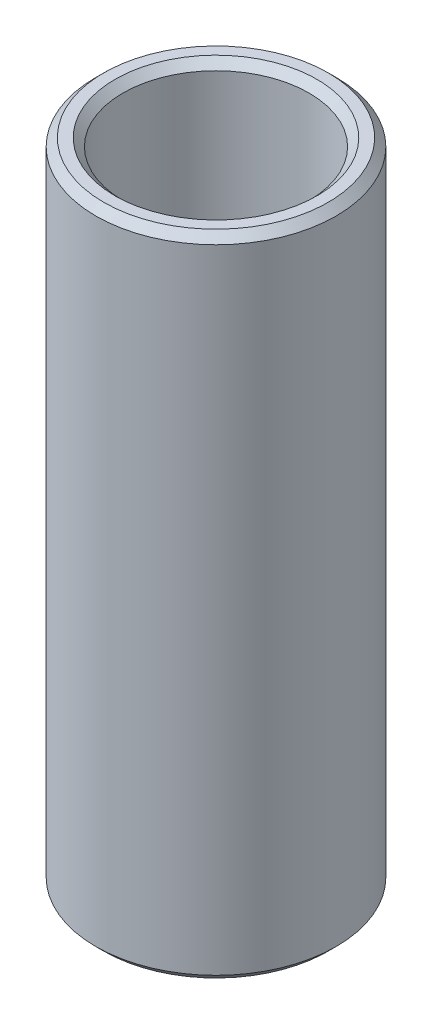
ISO-10303-21;
HEADER;
FILE_DESCRIPTION(('STEP AP214'),'2;1');
FILE_NAME('part.step','',(''),(''),'','','');
FILE_SCHEMA(('AUTOMOTIVE_DESIGN { 1 0 10303 214 1 1 1 1 }'));
ENDSEC;
DATA;
#1=APPLICATION_CONTEXT('core data for automotive mechanical design processes');
#2=APPLICATION_PROTOCOL_DEFINITION('international standard','automotive_design',2000,#1);
#3=PRODUCT_CONTEXT('',#1,'mechanical');
#4=PRODUCT('Part','Part','',(#3));
#5=PRODUCT_RELATED_PRODUCT_CATEGORY('part','',(#4));
#6=PRODUCT_DEFINITION_FORMATION('','',#4);
#7=PRODUCT_DEFINITION_CONTEXT('part definition',#1,'design');
#8=PRODUCT_DEFINITION('design','',#6,#7);
#9=PRODUCT_DEFINITION_SHAPE('','',#8);
#10=(LENGTH_UNIT() NAMED_UNIT(*) SI_UNIT(.MILLI.,.METRE.));
#11=(NAMED_UNIT(*) PLANE_ANGLE_UNIT() SI_UNIT($,.RADIAN.));
#12=(NAMED_UNIT(*) SI_UNIT($,.STERADIAN.) SOLID_ANGLE_UNIT());
#13=UNCERTAINTY_MEASURE_WITH_UNIT(LENGTH_MEASURE(1.E-05),#10,'distance_accuracy_value','');
#14=(GEOMETRIC_REPRESENTATION_CONTEXT(3) GLOBAL_UNCERTAINTY_ASSIGNED_CONTEXT((#13)) GLOBAL_UNIT_ASSIGNED_CONTEXT((#10,
#11,#12)) REPRESENTATION_CONTEXT('',''));
#15=CARTESIAN_POINT('',(0.,0.,0.));
#16=DIRECTION('',(0.,0.,1.));
#17=DIRECTION('',(1.,0.,0.));
#18=AXIS2_PLACEMENT_3D('',#15,#16,#17);
#19=CARTESIAN_POINT('',(0.,269.960897826019,0.));
#20=DIRECTION('',(0.,-1.,0.));
#21=DIRECTION('',(0.,0.,-1.));
#22=AXIS2_PLACEMENT_3D('',#19,#20,#21);
#23=CYLINDRICAL_SURFACE('',#22,50.);
#24=CARTESIAN_POINT('',(0.,3.29269688421191,0.));
#25=DIRECTION('',(0.,1.,0.));
#26=DIRECTION('',(0.,0.,1.));
#27=AXIS2_PLACEMENT_3D('',#24,#25,#26);
#28=CIRCLE('',#27,50.);
#29=CARTESIAN_POINT('',(0.,3.29269688421191,50.));
#30=VERTEX_POINT('',#29);
#31=EDGE_CURVE('E10',#30,#30,#28,.T.);
#32=ORIENTED_EDGE('',*,*,#31,.T.);
#33=EDGE_LOOP('',(#32));
#34=FACE_BOUND('',#33,.T.);
#35=CARTESIAN_POINT('',(0.,266.668200941807,0.));
#36=DIRECTION('',(0.,1.,0.));
#37=DIRECTION('',(0.,0.,1.));
#38=AXIS2_PLACEMENT_3D('',#35,#36,#37);
#39=CIRCLE('',#38,50.);
#40=CARTESIAN_POINT('',(0.,266.668200941807,50.));
#41=VERTEX_POINT('',#40);
#42=EDGE_CURVE('E50',#41,#41,#39,.F.);
#43=ORIENTED_EDGE('',*,*,#42,.T.);
#44=EDGE_LOOP('',(#43));
#45=FACE_BOUND('',#44,.T.);
#46=ADVANCED_FACE('F39',(#34,#45),#23,.T.);
#47=CARTESIAN_POINT('',(0.,269.960897826019,0.));
#48=DIRECTION('',(0.,1.,0.));
#49=DIRECTION('',(0.,0.,1.));
#50=AXIS2_PLACEMENT_3D('',#47,#48,#49);
#51=PLANE('',#50);
#52=CARTESIAN_POINT('',(0.,269.960897826019,0.));
#53=DIRECTION('',(0.,1.,0.));
#54=DIRECTION('',(0.,0.,1.));
#55=AXIS2_PLACEMENT_3D('',#52,#53,#54);
#56=CIRCLE('',#55,42.0311474916744);
#57=CARTESIAN_POINT('',(0.,269.960897826019,42.0311474916744));
#58=VERTEX_POINT('',#57);
#59=EDGE_CURVE('E58',#58,#58,#56,.F.);
#60=ORIENTED_EDGE('',*,*,#59,.T.);
#61=EDGE_LOOP('',(#60));
#62=FACE_BOUND('',#61,.T.);
#63=CARTESIAN_POINT('',(0.,269.960897826019,0.));
#64=DIRECTION('',(0.,1.,0.));
#65=DIRECTION('',(0.,0.,1.));
#66=AXIS2_PLACEMENT_3D('',#63,#64,#65);
#67=CIRCLE('',#66,46.707303115788);
#68=CARTESIAN_POINT('',(0.,269.960897826019,46.707303115788));
#69=VERTEX_POINT('',#68);
#70=EDGE_CURVE('E61',#69,#69,#67,.T.);
#71=ORIENTED_EDGE('',*,*,#70,.T.);
#72=EDGE_LOOP('',(#71));
#73=FACE_BOUND('',#72,.T.);
#74=ADVANCED_FACE('F88',(#62,#73),#51,.T.);
#75=CARTESIAN_POINT('',(0.,0.,0.));
#76=DIRECTION('',(0.,1.,0.));
#77=DIRECTION('',(0.,0.,1.));
#78=AXIS2_PLACEMENT_3D('',#75,#76,#77);
#79=PLANE('',#78);
#80=CARTESIAN_POINT('',(0.,0.,0.));
#81=DIRECTION('',(0.,1.,0.));
#82=DIRECTION('',(0.,0.,1.));
#83=AXIS2_PLACEMENT_3D('',#80,#81,#82);
#84=CIRCLE('',#83,42.0311474916744);
#85=CARTESIAN_POINT('',(0.,0.,42.0311474916744));
#86=VERTEX_POINT('',#85);
#87=EDGE_CURVE('E51',#86,#86,#84,.T.);
#88=ORIENTED_EDGE('',*,*,#87,.T.);
#89=EDGE_LOOP('',(#88));
#90=FACE_BOUND('',#89,.T.);
#91=CARTESIAN_POINT('',(0.,0.,0.));
#92=DIRECTION('',(0.,1.,0.));
#93=DIRECTION('',(0.,0.,1.));
#94=AXIS2_PLACEMENT_3D('',#91,#92,#93);
#95=CIRCLE('',#94,46.7073031157881);
#96=CARTESIAN_POINT('',(0.,0.,46.7073031157881));
#97=VERTEX_POINT('',#96);
#98=EDGE_CURVE('E54',#97,#97,#95,.F.);
#99=ORIENTED_EDGE('',*,*,#98,.T.);
#100=EDGE_LOOP('',(#99));
#101=FACE_BOUND('',#100,.T.);
#102=ADVANCED_FACE('F83',(#90,#101),#79,.F.);
#103=CARTESIAN_POINT('',(0.,269.960897826019,0.));
#104=DIRECTION('',(0.,-1.,0.));
#105=DIRECTION('',(0.,0.,-1.));
#106=AXIS2_PLACEMENT_3D('',#103,#104,#105);
#107=CYLINDRICAL_SURFACE('',#106,38.7384506074625);
#108=CARTESIAN_POINT('',(0.,266.668200941807,0.));
#109=DIRECTION('',(0.,1.,0.));
#110=DIRECTION('',(0.,0.,1.));
#111=AXIS2_PLACEMENT_3D('',#108,#109,#110);
#112=CIRCLE('',#111,38.7384506074625);
#113=CARTESIAN_POINT('',(0.,266.668200941807,38.7384506074625));
#114=VERTEX_POINT('',#113);
#115=EDGE_CURVE('E67',#114,#114,#112,.T.);
#116=ORIENTED_EDGE('',*,*,#115,.T.);
#117=EDGE_LOOP('',(#116));
#118=FACE_BOUND('',#117,.T.);
#119=CARTESIAN_POINT('',(0.,3.29269688421202,0.));
#120=DIRECTION('',(0.,1.,0.));
#121=DIRECTION('',(0.,0.,1.));
#122=AXIS2_PLACEMENT_3D('',#119,#120,#121);
#123=CIRCLE('',#122,38.7384506074625);
#124=CARTESIAN_POINT('',(0.,3.29269688421202,38.7384506074625));
#125=VERTEX_POINT('',#124);
#126=EDGE_CURVE('E69',#125,#125,#123,.F.);
#127=ORIENTED_EDGE('',*,*,#126,.T.);
#128=EDGE_LOOP('',(#127));
#129=FACE_BOUND('',#128,.T.);
#130=ADVANCED_FACE('F71',(#118,#129),#107,.F.);
#131=CARTESIAN_POINT('',(0.,266.668200941807,0.));
#132=DIRECTION('',(0.,1.,0.));
#133=DIRECTION('',(0.,0.,1.));
#134=AXIS2_PLACEMENT_3D('',#131,#132,#133);
#135=CONICAL_SURFACE('',#134,38.7384506074625,0.785398163397447);
#136=ORIENTED_EDGE('',*,*,#59,.F.);
#137=EDGE_LOOP('',(#136));
#138=FACE_BOUND('',#137,.T.);
#139=ORIENTED_EDGE('',*,*,#115,.F.);
#140=EDGE_LOOP('',(#139));
#141=FACE_BOUND('',#140,.T.);
#142=ADVANCED_FACE('F77',(#138,#141),#135,.F.);
#143=CARTESIAN_POINT('',(0.,0.,0.));
#144=DIRECTION('',(0.,-1.,0.));
#145=DIRECTION('',(0.,0.,-1.));
#146=AXIS2_PLACEMENT_3D('',#143,#144,#145);
#147=CONICAL_SURFACE('',#146,42.0311474916744,0.785398163397443);
#148=ORIENTED_EDGE('',*,*,#126,.F.);
#149=EDGE_LOOP('',(#148));
#150=FACE_BOUND('',#149,.T.);
#151=ORIENTED_EDGE('',*,*,#87,.F.);
#152=EDGE_LOOP('',(#151));
#153=FACE_BOUND('',#152,.T.);
#154=ADVANCED_FACE('F73',(#150,#153),#147,.F.);
#155=CARTESIAN_POINT('',(0.,3.29269688421191,0.));
#156=DIRECTION('',(0.,1.,0.));
#157=DIRECTION('',(0.,0.,1.));
#158=AXIS2_PLACEMENT_3D('',#155,#156,#157);
#159=CONICAL_SURFACE('',#158,50.,0.785398163397454);
#160=ORIENTED_EDGE('',*,*,#98,.F.);
#161=EDGE_LOOP('',(#160));
#162=FACE_BOUND('',#161,.T.);
#163=ORIENTED_EDGE('',*,*,#31,.F.);
#164=EDGE_LOOP('',(#163));
#165=FACE_BOUND('',#164,.T.);
#166=ADVANCED_FACE('F76',(#162,#165),#159,.T.);
#167=CARTESIAN_POINT('',(0.,269.960897826019,0.));
#168=DIRECTION('',(0.,-1.,0.));
#169=DIRECTION('',(0.,0.,-1.));
#170=AXIS2_PLACEMENT_3D('',#167,#168,#169);
#171=CONICAL_SURFACE('',#170,46.707303115788,0.785398163397435);
#172=ORIENTED_EDGE('',*,*,#42,.F.);
#173=EDGE_LOOP('',(#172));
#174=FACE_BOUND('',#173,.T.);
#175=ORIENTED_EDGE('',*,*,#70,.F.);
#176=EDGE_LOOP('',(#175));
#177=FACE_BOUND('',#176,.T.);
#178=ADVANCED_FACE('F45',(#174,#177),#171,.T.);
#179=CLOSED_SHELL('',(#46,#74,#102,#130,#142,#154,#166,#178));
#180=MANIFOLD_SOLID_BREP('B2',#179);
#181=ADVANCED_BREP_SHAPE_REPRESENTATION('',(#18,#180),#14);
#182=SHAPE_DEFINITION_REPRESENTATION(#9,#181);
ENDSEC;
END-ISO-10303-21;
